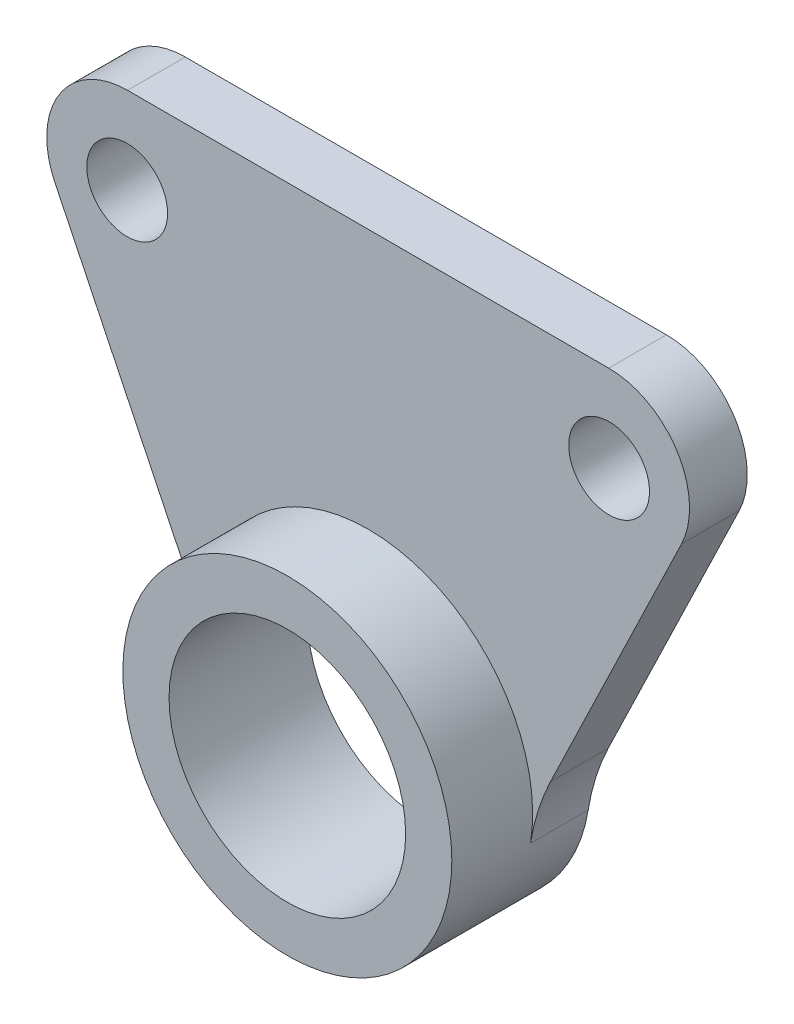
ISO-10303-21;
HEADER;
FILE_DESCRIPTION(('STEP AP214'),'2;1');
FILE_NAME('part.step','',(''),(''),'','','');
FILE_SCHEMA(('AUTOMOTIVE_DESIGN { 1 0 10303 214 1 1 1 1 }'));
ENDSEC;
DATA;
#1=APPLICATION_CONTEXT('core data for automotive mechanical design processes');
#2=APPLICATION_PROTOCOL_DEFINITION('international standard','automotive_design',2000,#1);
#3=PRODUCT_CONTEXT('',#1,'mechanical');
#4=PRODUCT('Part','Part','',(#3));
#5=PRODUCT_RELATED_PRODUCT_CATEGORY('part','',(#4));
#6=PRODUCT_DEFINITION_FORMATION('','',#4);
#7=PRODUCT_DEFINITION_CONTEXT('part definition',#1,'design');
#8=PRODUCT_DEFINITION('design','',#6,#7);
#9=PRODUCT_DEFINITION_SHAPE('','',#8);
#10=(LENGTH_UNIT() NAMED_UNIT(*) SI_UNIT(.MILLI.,.METRE.));
#11=(NAMED_UNIT(*) PLANE_ANGLE_UNIT() SI_UNIT($,.RADIAN.));
#12=(NAMED_UNIT(*) SI_UNIT($,.STERADIAN.) SOLID_ANGLE_UNIT());
#13=UNCERTAINTY_MEASURE_WITH_UNIT(LENGTH_MEASURE(1.E-05),#10,'distance_accuracy_value','');
#14=(GEOMETRIC_REPRESENTATION_CONTEXT(3) GLOBAL_UNCERTAINTY_ASSIGNED_CONTEXT((#13)) GLOBAL_UNIT_ASSIGNED_CONTEXT((#10,
#11,#12)) REPRESENTATION_CONTEXT('',''));
#15=CARTESIAN_POINT('',(0.,0.,0.));
#16=DIRECTION('',(0.,0.,1.));
#17=DIRECTION('',(1.,0.,0.));
#18=AXIS2_PLACEMENT_3D('',#15,#16,#17);
#19=CARTESIAN_POINT('',(0.,0.,6.));
#20=DIRECTION('',(0.,0.,-1.));
#21=DIRECTION('',(-1.,0.,0.));
#22=AXIS2_PLACEMENT_3D('',#19,#20,#21);
#23=CYLINDRICAL_SURFACE('',#22,7.125);
#24=CARTESIAN_POINT('',(0.,0.,6.));
#25=DIRECTION('',(0.,0.,1.));
#26=DIRECTION('',(1.,0.,0.));
#27=AXIS2_PLACEMENT_3D('',#24,#25,#26);
#28=CIRCLE('',#27,7.125);
#29=CARTESIAN_POINT('',(7.125,0.,6.));
#30=VERTEX_POINT('',#29);
#31=EDGE_CURVE('E153',#30,#30,#28,.T.);
#32=ORIENTED_EDGE('',*,*,#31,.F.);
#33=EDGE_LOOP('',(#32));
#34=FACE_BOUND('',#33,.T.);
#35=CARTESIAN_POINT('',(0.,0.,2.5));
#36=DIRECTION('',(0.,0.,1.));
#37=DIRECTION('',(1.,0.,0.));
#38=AXIS2_PLACEMENT_3D('',#35,#36,#37);
#39=CIRCLE('',#38,7.125);
#40=CARTESIAN_POINT('',(7.03270223001007,-1.1431204416033,2.5));
#41=VERTEX_POINT('',#40);
#42=CARTESIAN_POINT('',(-7.03270223001007,-1.1431204416033,2.5));
#43=VERTEX_POINT('',#42);
#44=EDGE_CURVE('E211',#41,#43,#39,.T.);
#45=ORIENTED_EDGE('',*,*,#44,.T.);
#46=DIRECTION('',(0.,0.,-1.));
#47=VECTOR('',#46,1.);
#48=CARTESIAN_POINT('',(-7.03270223001008,-1.1431204416033,6.));
#49=LINE('',#48,#47);
#50=CARTESIAN_POINT('',(-7.03270223001007,-1.1431204416033,0.));
#51=VERTEX_POINT('',#50);
#52=EDGE_CURVE('E187',#43,#51,#49,.T.);
#53=ORIENTED_EDGE('',*,*,#52,.T.);
#54=CARTESIAN_POINT('',(0.,0.,0.));
#55=DIRECTION('',(0.,0.,1.));
#56=DIRECTION('',(1.,0.,0.));
#57=AXIS2_PLACEMENT_3D('',#54,#55,#56);
#58=CIRCLE('',#57,7.125);
#59=CARTESIAN_POINT('',(7.03270223001007,-1.1431204416033,0.));
#60=VERTEX_POINT('',#59);
#61=EDGE_CURVE('E154',#51,#60,#58,.T.);
#62=ORIENTED_EDGE('',*,*,#61,.T.);
#63=DIRECTION('',(0.,0.,-1.));
#64=VECTOR('',#63,1.);
#65=CARTESIAN_POINT('',(7.03270223001008,-1.1431204416033,6.));
#66=LINE('',#65,#64);
#67=EDGE_CURVE('E183',#60,#41,#66,.F.);
#68=ORIENTED_EDGE('',*,*,#67,.T.);
#69=EDGE_LOOP('',(#45,#53,#62,#68));
#70=FACE_BOUND('',#69,.T.);
#71=ADVANCED_FACE('F45',(#34,#70),#23,.T.);
#72=CARTESIAN_POINT('',(0.,0.,6.));
#73=DIRECTION('',(0.,0.,-1.));
#74=DIRECTION('',(-1.,0.,0.));
#75=AXIS2_PLACEMENT_3D('',#72,#73,#74);
#76=CYLINDRICAL_SURFACE('',#75,5.125);
#77=CARTESIAN_POINT('',(0.,0.,6.));
#78=DIRECTION('',(0.,0.,1.));
#79=DIRECTION('',(1.,0.,0.));
#80=AXIS2_PLACEMENT_3D('',#77,#78,#79);
#81=CIRCLE('',#80,5.125);
#82=CARTESIAN_POINT('',(5.125,0.,6.));
#83=VERTEX_POINT('',#82);
#84=EDGE_CURVE('E149',#83,#83,#81,.T.);
#85=ORIENTED_EDGE('',*,*,#84,.T.);
#86=EDGE_LOOP('',(#85));
#87=FACE_BOUND('',#86,.T.);
#88=CARTESIAN_POINT('',(0.,0.,0.));
#89=DIRECTION('',(0.,0.,1.));
#90=DIRECTION('',(1.,0.,0.));
#91=AXIS2_PLACEMENT_3D('',#88,#89,#90);
#92=CIRCLE('',#91,5.125);
#93=CARTESIAN_POINT('',(5.125,0.,0.));
#94=VERTEX_POINT('',#93);
#95=EDGE_CURVE('E158',#94,#94,#92,.T.);
#96=ORIENTED_EDGE('',*,*,#95,.F.);
#97=EDGE_LOOP('',(#96));
#98=FACE_BOUND('',#97,.T.);
#99=ADVANCED_FACE('F246',(#87,#98),#76,.F.);
#100=CARTESIAN_POINT('',(0.,0.,6.));
#101=DIRECTION('',(0.,0.,1.));
#102=DIRECTION('',(1.,0.,0.));
#103=AXIS2_PLACEMENT_3D('',#100,#101,#102);
#104=PLANE('',#103);
#105=ORIENTED_EDGE('',*,*,#84,.F.);
#106=EDGE_LOOP('',(#105));
#107=FACE_BOUND('',#106,.T.);
#108=ORIENTED_EDGE('',*,*,#31,.T.);
#109=EDGE_LOOP('',(#108));
#110=FACE_BOUND('',#109,.T.);
#111=ADVANCED_FACE('F252',(#107,#110),#104,.T.);
#112=CARTESIAN_POINT('',(0.,0.,0.));
#113=DIRECTION('',(0.,0.,1.));
#114=DIRECTION('',(1.,0.,0.));
#115=AXIS2_PLACEMENT_3D('',#112,#113,#114);
#116=PLANE('',#115);
#117=ORIENTED_EDGE('',*,*,#95,.T.);
#118=EDGE_LOOP('',(#117));
#119=FACE_BOUND('',#118,.T.);
#120=DIRECTION('',(-1.,0.,0.));
#121=VECTOR('',#120,1.);
#122=CARTESIAN_POINT('',(0.,18.375,0.));
#123=LINE('',#122,#121);
#124=CARTESIAN_POINT('',(10.4214955033631,18.375,0.));
#125=VERTEX_POINT('',#124);
#126=CARTESIAN_POINT('',(-10.4214955033631,18.375,0.));
#127=VERTEX_POINT('',#126);
#128=EDGE_CURVE('E127',#125,#127,#123,.T.);
#129=ORIENTED_EDGE('',*,*,#128,.F.);
#130=CARTESIAN_POINT('',(10.4214955033631,14.875,0.));
#131=DIRECTION('',(0.,0.,1.));
#132=DIRECTION('',(1.,0.,0.));
#133=AXIS2_PLACEMENT_3D('',#130,#131,#132);
#134=CIRCLE('',#133,3.5);
#135=CARTESIAN_POINT('',(13.5732443699732,13.3530016156968,0.));
#136=VERTEX_POINT('',#135);
#137=EDGE_CURVE('E110',#125,#136,#134,.F.);
#138=ORIENTED_EDGE('',*,*,#137,.T.);
#139=DIRECTION('',(0.434856681229485,0.900499676174333,0.));
#140=VECTOR('',#139,1.);
#141=CARTESIAN_POINT('',(5.77766012587931,-2.79006664198445,0.));
#142=LINE('',#141,#140);
#143=CARTESIAN_POINT('',(7.89816473845632,1.60106680352902,0.));
#144=VERTEX_POINT('',#143);
#145=EDGE_CURVE('E139',#144,#136,#142,.T.);
#146=ORIENTED_EDGE('',*,*,#145,.F.);
#147=CARTESIAN_POINT('',(16.9031615001997,-2.74750000876583,0.));
#148=DIRECTION('',(0.,0.,1.));
#149=DIRECTION('',(1.,0.,0.));
#150=AXIS2_PLACEMENT_3D('',#147,#148,#149);
#151=CIRCLE('',#150,10.);
#152=EDGE_CURVE('E54',#144,#60,#151,.T.);
#153=ORIENTED_EDGE('',*,*,#152,.T.);
#154=ORIENTED_EDGE('',*,*,#61,.F.);
#155=CARTESIAN_POINT('',(-16.9031615001997,-2.74750000876583,0.));
#156=DIRECTION('',(0.,0.,1.));
#157=DIRECTION('',(1.,0.,0.));
#158=AXIS2_PLACEMENT_3D('',#155,#156,#157);
#159=CIRCLE('',#158,10.);
#160=CARTESIAN_POINT('',(-7.89816473845632,1.60106680352902,0.));
#161=VERTEX_POINT('',#160);
#162=EDGE_CURVE('E197',#51,#161,#159,.T.);
#163=ORIENTED_EDGE('',*,*,#162,.T.);
#164=DIRECTION('',(-0.434856681229485,0.900499676174333,0.));
#165=VECTOR('',#164,1.);
#166=CARTESIAN_POINT('',(-5.77766012587931,-2.79006664198445,0.));
#167=LINE('',#166,#165);
#168=CARTESIAN_POINT('',(-13.5732443699732,13.3530016156968,0.));
#169=VERTEX_POINT('',#168);
#170=EDGE_CURVE('E138',#161,#169,#167,.T.);
#171=ORIENTED_EDGE('',*,*,#170,.T.);
#172=CARTESIAN_POINT('',(-10.4214955033631,14.875,0.));
#173=DIRECTION('',(0.,0.,1.));
#174=DIRECTION('',(1.,0.,0.));
#175=AXIS2_PLACEMENT_3D('',#172,#173,#174);
#176=CIRCLE('',#175,3.5);
#177=EDGE_CURVE('E121',#169,#127,#176,.F.);
#178=ORIENTED_EDGE('',*,*,#177,.T.);
#179=EDGE_LOOP('',(#129,#138,#146,#153,#154,#163,#171,#178));
#180=FACE_BOUND('',#179,.T.);
#181=CARTESIAN_POINT('',(10.4375,14.625,0.));
#182=DIRECTION('',(0.,0.,1.));
#183=DIRECTION('',(1.,0.,0.));
#184=AXIS2_PLACEMENT_3D('',#181,#182,#183);
#185=CIRCLE('',#184,1.75);
#186=CARTESIAN_POINT('',(12.1875,14.625,0.));
#187=VERTEX_POINT('',#186);
#188=EDGE_CURVE('E222',#187,#187,#185,.T.);
#189=ORIENTED_EDGE('',*,*,#188,.T.);
#190=EDGE_LOOP('',(#189));
#191=FACE_BOUND('',#190,.T.);
#192=CARTESIAN_POINT('',(-10.4375,14.625,0.));
#193=DIRECTION('',(0.,0.,1.));
#194=DIRECTION('',(1.,0.,0.));
#195=AXIS2_PLACEMENT_3D('',#192,#193,#194);
#196=CIRCLE('',#195,1.75);
#197=CARTESIAN_POINT('',(-8.6875,14.625,0.));
#198=VERTEX_POINT('',#197);
#199=EDGE_CURVE('E145',#198,#198,#196,.T.);
#200=ORIENTED_EDGE('',*,*,#199,.T.);
#201=EDGE_LOOP('',(#200));
#202=FACE_BOUND('',#201,.T.);
#203=ADVANCED_FACE('F134',(#119,#180,#191,#202),#116,.F.);
#204=CARTESIAN_POINT('',(5.77766012587931,-2.79006664198445,2.5));
#205=DIRECTION('',(-0.900499676174333,0.434856681229485,0.));
#206=DIRECTION('',(-0.434856681229485,-0.900499676174333,0.));
#207=AXIS2_PLACEMENT_3D('',#204,#205,#206);
#208=PLANE('',#207);
#209=DIRECTION('',(0.434856681229485,0.900499676174333,0.));
#210=VECTOR('',#209,1.);
#211=CARTESIAN_POINT('',(5.77766012587931,-2.79006664198445,2.5));
#212=LINE('',#211,#210);
#213=CARTESIAN_POINT('',(7.89816473845632,1.60106680352902,2.5));
#214=VERTEX_POINT('',#213);
#215=CARTESIAN_POINT('',(13.5732443699732,13.3530016156968,2.5));
#216=VERTEX_POINT('',#215);
#217=EDGE_CURVE('E209',#214,#216,#212,.T.);
#218=ORIENTED_EDGE('',*,*,#217,.F.);
#219=DIRECTION('',(0.,0.,1.));
#220=VECTOR('',#219,1.);
#221=CARTESIAN_POINT('',(7.89816473845632,1.60106680352902,0.));
#222=LINE('',#221,#220);
#223=EDGE_CURVE('E194',#214,#144,#222,.F.);
#224=ORIENTED_EDGE('',*,*,#223,.T.);
#225=ORIENTED_EDGE('',*,*,#145,.T.);
#226=DIRECTION('',(0.,0.,-1.));
#227=VECTOR('',#226,1.);
#228=CARTESIAN_POINT('',(13.5732443699732,13.3530016156968,2.5));
#229=LINE('',#228,#227);
#230=EDGE_CURVE('E116',#136,#216,#229,.F.);
#231=ORIENTED_EDGE('',*,*,#230,.T.);
#232=EDGE_LOOP('',(#218,#224,#225,#231));
#233=FACE_BOUND('',#232,.T.);
#234=ADVANCED_FACE('F208',(#233),#208,.F.);
#235=CARTESIAN_POINT('',(0.,18.375,2.5));
#236=DIRECTION('',(0.,-1.,0.));
#237=DIRECTION('',(0.,0.,-1.));
#238=AXIS2_PLACEMENT_3D('',#235,#236,#237);
#239=PLANE('',#238);
#240=DIRECTION('',(-1.,0.,0.));
#241=VECTOR('',#240,1.);
#242=CARTESIAN_POINT('',(0.,18.375,2.5));
#243=LINE('',#242,#241);
#244=CARTESIAN_POINT('',(10.4214955033631,18.375,2.5));
#245=VERTEX_POINT('',#244);
#246=CARTESIAN_POINT('',(-10.4214955033631,18.375,2.5));
#247=VERTEX_POINT('',#246);
#248=EDGE_CURVE('E130',#245,#247,#243,.T.);
#249=ORIENTED_EDGE('',*,*,#248,.F.);
#250=DIRECTION('',(0.,0.,-1.));
#251=VECTOR('',#250,1.);
#252=CARTESIAN_POINT('',(10.4214955033631,18.375,2.5));
#253=LINE('',#252,#251);
#254=EDGE_CURVE('E114',#245,#125,#253,.T.);
#255=ORIENTED_EDGE('',*,*,#254,.T.);
#256=ORIENTED_EDGE('',*,*,#128,.T.);
#257=DIRECTION('',(0.,0.,-1.));
#258=VECTOR('',#257,1.);
#259=CARTESIAN_POINT('',(-10.4214955033631,18.375,2.5));
#260=LINE('',#259,#258);
#261=EDGE_CURVE('E132',#127,#247,#260,.F.);
#262=ORIENTED_EDGE('',*,*,#261,.T.);
#263=EDGE_LOOP('',(#249,#255,#256,#262));
#264=FACE_BOUND('',#263,.T.);
#265=ADVANCED_FACE('F126',(#264),#239,.F.);
#266=CARTESIAN_POINT('',(-10.4375,14.625,2.5));
#267=DIRECTION('',(0.,0.,-1.));
#268=DIRECTION('',(-1.,0.,0.));
#269=AXIS2_PLACEMENT_3D('',#266,#267,#268);
#270=CYLINDRICAL_SURFACE('',#269,1.75);
#271=CARTESIAN_POINT('',(-10.4375,14.625,2.5));
#272=DIRECTION('',(0.,0.,1.));
#273=DIRECTION('',(1.,0.,0.));
#274=AXIS2_PLACEMENT_3D('',#271,#272,#273);
#275=CIRCLE('',#274,1.75);
#276=CARTESIAN_POINT('',(-8.6875,14.625,2.5));
#277=VERTEX_POINT('',#276);
#278=EDGE_CURVE('E216',#277,#277,#275,.T.);
#279=ORIENTED_EDGE('',*,*,#278,.T.);
#280=EDGE_LOOP('',(#279));
#281=FACE_BOUND('',#280,.T.);
#282=ORIENTED_EDGE('',*,*,#199,.F.);
#283=EDGE_LOOP('',(#282));
#284=FACE_BOUND('',#283,.T.);
#285=ADVANCED_FACE('F230',(#281,#284),#270,.F.);
#286=CARTESIAN_POINT('',(10.4375,14.625,2.5));
#287=DIRECTION('',(0.,0.,-1.));
#288=DIRECTION('',(-1.,0.,0.));
#289=AXIS2_PLACEMENT_3D('',#286,#287,#288);
#290=CYLINDRICAL_SURFACE('',#289,1.75);
#291=CARTESIAN_POINT('',(10.4375,14.625,2.5));
#292=DIRECTION('',(0.,0.,1.));
#293=DIRECTION('',(1.,0.,0.));
#294=AXIS2_PLACEMENT_3D('',#291,#292,#293);
#295=CIRCLE('',#294,1.75);
#296=CARTESIAN_POINT('',(12.1875,14.625,2.5));
#297=VERTEX_POINT('',#296);
#298=EDGE_CURVE('E143',#297,#297,#295,.T.);
#299=ORIENTED_EDGE('',*,*,#298,.T.);
#300=EDGE_LOOP('',(#299));
#301=FACE_BOUND('',#300,.T.);
#302=ORIENTED_EDGE('',*,*,#188,.F.);
#303=EDGE_LOOP('',(#302));
#304=FACE_BOUND('',#303,.T.);
#305=ADVANCED_FACE('F232',(#301,#304),#290,.F.);
#306=CARTESIAN_POINT('',(-5.77766012587931,-2.79006664198445,2.5));
#307=DIRECTION('',(-0.900499676174333,-0.434856681229485,0.));
#308=DIRECTION('',(0.434856681229485,-0.900499676174333,0.));
#309=AXIS2_PLACEMENT_3D('',#306,#307,#308);
#310=PLANE('',#309);
#311=ORIENTED_EDGE('',*,*,#170,.F.);
#312=DIRECTION('',(0.,0.,-1.));
#313=VECTOR('',#312,1.);
#314=CARTESIAN_POINT('',(-7.89816473845632,1.60106680352902,2.5));
#315=LINE('',#314,#313);
#316=CARTESIAN_POINT('',(-7.89816473845632,1.60106680352902,2.5));
#317=VERTEX_POINT('',#316);
#318=EDGE_CURVE('E191',#161,#317,#315,.F.);
#319=ORIENTED_EDGE('',*,*,#318,.T.);
#320=DIRECTION('',(-0.434856681229485,0.900499676174333,0.));
#321=VECTOR('',#320,1.);
#322=CARTESIAN_POINT('',(-5.77766012587931,-2.79006664198445,2.5));
#323=LINE('',#322,#321);
#324=CARTESIAN_POINT('',(-13.5732443699732,13.3530016156968,2.5));
#325=VERTEX_POINT('',#324);
#326=EDGE_CURVE('E162',#317,#325,#323,.T.);
#327=ORIENTED_EDGE('',*,*,#326,.T.);
#328=DIRECTION('',(0.,0.,-1.));
#329=VECTOR('',#328,1.);
#330=CARTESIAN_POINT('',(-13.5732443699732,13.3530016156968,0.));
#331=LINE('',#330,#329);
#332=EDGE_CURVE('E179',#325,#169,#331,.T.);
#333=ORIENTED_EDGE('',*,*,#332,.T.);
#334=EDGE_LOOP('',(#311,#319,#327,#333));
#335=FACE_BOUND('',#334,.T.);
#336=ADVANCED_FACE('F239',(#335),#310,.T.);
#337=CARTESIAN_POINT('',(0.,0.,2.5));
#338=DIRECTION('',(0.,0.,1.));
#339=DIRECTION('',(1.,0.,0.));
#340=AXIS2_PLACEMENT_3D('',#337,#338,#339);
#341=PLANE('',#340);
#342=ORIENTED_EDGE('',*,*,#298,.F.);
#343=EDGE_LOOP('',(#342));
#344=FACE_BOUND('',#343,.T.);
#345=ORIENTED_EDGE('',*,*,#278,.F.);
#346=EDGE_LOOP('',(#345));
#347=FACE_BOUND('',#346,.T.);
#348=ORIENTED_EDGE('',*,*,#44,.F.);
#349=CARTESIAN_POINT('',(16.9031615001997,-2.74750000876583,2.5));
#350=DIRECTION('',(0.,0.,1.));
#351=DIRECTION('',(1.,0.,0.));
#352=AXIS2_PLACEMENT_3D('',#349,#350,#351);
#353=CIRCLE('',#352,10.);
#354=EDGE_CURVE('E11',#41,#214,#353,.F.);
#355=ORIENTED_EDGE('',*,*,#354,.T.);
#356=ORIENTED_EDGE('',*,*,#217,.T.);
#357=CARTESIAN_POINT('',(10.4214955033631,14.875,2.5));
#358=DIRECTION('',(0.,0.,1.));
#359=DIRECTION('',(1.,0.,0.));
#360=AXIS2_PLACEMENT_3D('',#357,#358,#359);
#361=CIRCLE('',#360,3.5);
#362=EDGE_CURVE('E176',#216,#245,#361,.T.);
#363=ORIENTED_EDGE('',*,*,#362,.T.);
#364=ORIENTED_EDGE('',*,*,#248,.T.);
#365=CARTESIAN_POINT('',(-10.4214955033631,14.875,2.5));
#366=DIRECTION('',(0.,0.,1.));
#367=DIRECTION('',(1.,0.,0.));
#368=AXIS2_PLACEMENT_3D('',#365,#366,#367);
#369=CIRCLE('',#368,3.5);
#370=EDGE_CURVE('E172',#247,#325,#369,.T.);
#371=ORIENTED_EDGE('',*,*,#370,.T.);
#372=ORIENTED_EDGE('',*,*,#326,.F.);
#373=CARTESIAN_POINT('',(-16.9031615001997,-2.74750000876583,2.5));
#374=DIRECTION('',(0.,0.,1.));
#375=DIRECTION('',(1.,0.,0.));
#376=AXIS2_PLACEMENT_3D('',#373,#374,#375);
#377=CIRCLE('',#376,10.);
#378=EDGE_CURVE('E200',#317,#43,#377,.F.);
#379=ORIENTED_EDGE('',*,*,#378,.T.);
#380=EDGE_LOOP('',(#348,#355,#356,#363,#364,#371,#372,#379));
#381=FACE_BOUND('',#380,.T.);
#382=ADVANCED_FACE('F262',(#344,#347,#381),#341,.T.);
#383=CARTESIAN_POINT('',(10.4214955033631,14.875,2.5));
#384=DIRECTION('',(0.,0.,-1.));
#385=DIRECTION('',(-1.,0.,0.));
#386=AXIS2_PLACEMENT_3D('',#383,#384,#385);
#387=CYLINDRICAL_SURFACE('',#386,3.5);
#388=ORIENTED_EDGE('',*,*,#362,.F.);
#389=ORIENTED_EDGE('',*,*,#230,.F.);
#390=ORIENTED_EDGE('',*,*,#137,.F.);
#391=ORIENTED_EDGE('',*,*,#254,.F.);
#392=EDGE_LOOP('',(#388,#389,#390,#391));
#393=FACE_BOUND('',#392,.T.);
#394=ADVANCED_FACE('F113',(#393),#387,.T.);
#395=CARTESIAN_POINT('',(-10.4214955033631,14.875,2.5));
#396=DIRECTION('',(0.,0.,1.));
#397=DIRECTION('',(1.,0.,0.));
#398=AXIS2_PLACEMENT_3D('',#395,#396,#397);
#399=CYLINDRICAL_SURFACE('',#398,3.5);
#400=ORIENTED_EDGE('',*,*,#370,.F.);
#401=ORIENTED_EDGE('',*,*,#261,.F.);
#402=ORIENTED_EDGE('',*,*,#177,.F.);
#403=ORIENTED_EDGE('',*,*,#332,.F.);
#404=EDGE_LOOP('',(#400,#401,#402,#403));
#405=FACE_BOUND('',#404,.T.);
#406=ADVANCED_FACE('F261',(#405),#399,.T.);
#407=CARTESIAN_POINT('',(-16.9031615001997,-2.74750000876583,6.));
#408=DIRECTION('',(0.,0.,-1.));
#409=DIRECTION('',(-1.,0.,0.));
#410=AXIS2_PLACEMENT_3D('',#407,#408,#409);
#411=CYLINDRICAL_SURFACE('',#410,10.);
#412=ORIENTED_EDGE('',*,*,#378,.F.);
#413=ORIENTED_EDGE('',*,*,#318,.F.);
#414=ORIENTED_EDGE('',*,*,#162,.F.);
#415=ORIENTED_EDGE('',*,*,#52,.F.);
#416=EDGE_LOOP('',(#412,#413,#414,#415));
#417=FACE_BOUND('',#416,.T.);
#418=ADVANCED_FACE('F264',(#417),#411,.F.);
#419=CARTESIAN_POINT('',(16.9031615001997,-2.74750000876583,6.));
#420=DIRECTION('',(0.,0.,-1.));
#421=DIRECTION('',(-1.,0.,0.));
#422=AXIS2_PLACEMENT_3D('',#419,#420,#421);
#423=CYLINDRICAL_SURFACE('',#422,10.);
#424=ORIENTED_EDGE('',*,*,#354,.F.);
#425=ORIENTED_EDGE('',*,*,#67,.F.);
#426=ORIENTED_EDGE('',*,*,#152,.F.);
#427=ORIENTED_EDGE('',*,*,#223,.F.);
#428=EDGE_LOOP('',(#424,#425,#426,#427));
#429=FACE_BOUND('',#428,.T.);
#430=ADVANCED_FACE('F47',(#429),#423,.F.);
#431=CLOSED_SHELL('',(#71,#99,#111,#203,#234,#265,#285,#305,#336,#382,#394,#406,#418,#430));
#432=MANIFOLD_SOLID_BREP('B2',#431);
#433=ADVANCED_BREP_SHAPE_REPRESENTATION('',(#18,#432),#14);
#434=SHAPE_DEFINITION_REPRESENTATION(#9,#433);
ENDSEC;
END-ISO-10303-21;
